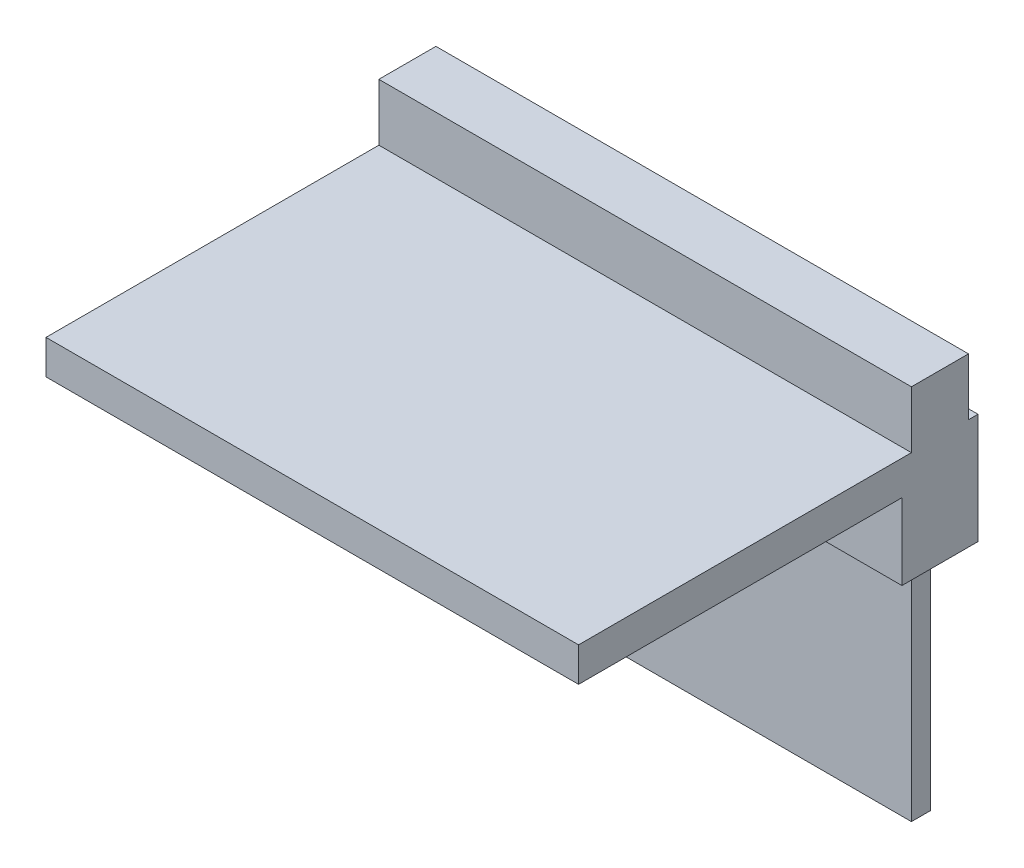
ISO-10303-21;
HEADER;
FILE_DESCRIPTION(('STEP AP214'),'2;1');
FILE_NAME('part.step','',(''),(''),'','','');
FILE_SCHEMA(('AUTOMOTIVE_DESIGN { 1 0 10303 214 1 1 1 1 }'));
ENDSEC;
DATA;
#1=APPLICATION_CONTEXT('core data for automotive mechanical design processes');
#2=APPLICATION_PROTOCOL_DEFINITION('international standard','automotive_design',2000,#1);
#3=PRODUCT_CONTEXT('',#1,'mechanical');
#4=PRODUCT('Part','Part','',(#3));
#5=PRODUCT_RELATED_PRODUCT_CATEGORY('part','',(#4));
#6=PRODUCT_DEFINITION_FORMATION('','',#4);
#7=PRODUCT_DEFINITION_CONTEXT('part definition',#1,'design');
#8=PRODUCT_DEFINITION('design','',#6,#7);
#9=PRODUCT_DEFINITION_SHAPE('','',#8);
#10=(LENGTH_UNIT() NAMED_UNIT(*) SI_UNIT(.MILLI.,.METRE.));
#11=(NAMED_UNIT(*) PLANE_ANGLE_UNIT() SI_UNIT($,.RADIAN.));
#12=(NAMED_UNIT(*) SI_UNIT($,.STERADIAN.) SOLID_ANGLE_UNIT());
#13=UNCERTAINTY_MEASURE_WITH_UNIT(LENGTH_MEASURE(1.E-05),#10,'distance_accuracy_value','');
#14=(GEOMETRIC_REPRESENTATION_CONTEXT(3) GLOBAL_UNCERTAINTY_ASSIGNED_CONTEXT((#13)) GLOBAL_UNIT_ASSIGNED_CONTEXT((#10,
#11,#12)) REPRESENTATION_CONTEXT('',''));
#15=CARTESIAN_POINT('',(0.,0.,0.));
#16=DIRECTION('',(0.,0.,1.));
#17=DIRECTION('',(1.,0.,0.));
#18=AXIS2_PLACEMENT_3D('',#15,#16,#17);
#19=CARTESIAN_POINT('',(0.,0.9,0.));
#20=DIRECTION('',(0.,-1.,0.));
#21=DIRECTION('',(0.,0.,-1.));
#22=AXIS2_PLACEMENT_3D('',#19,#20,#21);
#23=PLANE('',#22);
#24=DIRECTION('',(-1.,0.,0.));
#25=VECTOR('',#24,1.);
#26=CARTESIAN_POINT('',(7.,0.9,-5.));
#27=LINE('',#26,#25);
#28=CARTESIAN_POINT('',(7.,0.9,-5.));
#29=VERTEX_POINT('',#28);
#30=CARTESIAN_POINT('',(-7.,0.9,-5.));
#31=VERTEX_POINT('',#30);
#32=EDGE_CURVE('E153',#29,#31,#27,.T.);
#33=ORIENTED_EDGE('',*,*,#32,.F.);
#34=DIRECTION('',(0.,0.,-1.));
#35=VECTOR('',#34,1.);
#36=CARTESIAN_POINT('',(7.,0.9,5.25));
#37=LINE('',#36,#35);
#38=CARTESIAN_POINT('',(7.,0.9,-5.25));
#39=VERTEX_POINT('',#38);
#40=EDGE_CURVE('E219',#29,#39,#37,.T.);
#41=ORIENTED_EDGE('',*,*,#40,.T.);
#42=DIRECTION('',(-1.,0.,0.));
#43=VECTOR('',#42,1.);
#44=CARTESIAN_POINT('',(-7.,0.9,-5.25));
#45=LINE('',#44,#43);
#46=CARTESIAN_POINT('',(-7.,0.9,-5.25));
#47=VERTEX_POINT('',#46);
#48=EDGE_CURVE('E218',#39,#47,#45,.T.);
#49=ORIENTED_EDGE('',*,*,#48,.T.);
#50=DIRECTION('',(0.,0.,1.));
#51=VECTOR('',#50,1.);
#52=CARTESIAN_POINT('',(-7.,0.9,5.25));
#53=LINE('',#52,#51);
#54=EDGE_CURVE('E57',#47,#31,#53,.T.);
#55=ORIENTED_EDGE('',*,*,#54,.T.);
#56=EDGE_LOOP('',(#33,#41,#49,#55));
#57=FACE_BOUND('',#56,.T.);
#58=ADVANCED_FACE('F34',(#57),#23,.F.);
#59=DIRECTION('',(1.,0.,0.));
#60=VECTOR('',#59,1.);
#61=CARTESIAN_POINT('',(7.,0.9,-3.5));
#62=LINE('',#61,#60);
#63=CARTESIAN_POINT('',(-7.,0.9,-3.5));
#64=VERTEX_POINT('',#63);
#65=CARTESIAN_POINT('',(7.,0.9,-3.5));
#66=VERTEX_POINT('',#65);
#67=EDGE_CURVE('E49',#64,#66,#62,.T.);
#68=ORIENTED_EDGE('',*,*,#67,.F.);
#69=CARTESIAN_POINT('',(-7.,0.9,5.25));
#70=VERTEX_POINT('',#69);
#71=EDGE_CURVE('E157',#64,#70,#53,.T.);
#72=ORIENTED_EDGE('',*,*,#71,.T.);
#73=DIRECTION('',(1.,0.,0.));
#74=VECTOR('',#73,1.);
#75=CARTESIAN_POINT('',(-7.,0.9,5.25));
#76=LINE('',#75,#74);
#77=CARTESIAN_POINT('',(7.,0.9,5.25));
#78=VERTEX_POINT('',#77);
#79=EDGE_CURVE('E222',#70,#78,#76,.T.);
#80=ORIENTED_EDGE('',*,*,#79,.T.);
#81=EDGE_CURVE('E216',#78,#66,#37,.T.);
#82=ORIENTED_EDGE('',*,*,#81,.T.);
#83=EDGE_LOOP('',(#68,#72,#80,#82));
#84=FACE_BOUND('',#83,.T.);
#85=ADVANCED_FACE('F261',(#84),#23,.F.);
#86=CARTESIAN_POINT('',(0.,-2.,0.));
#87=DIRECTION('',(0.,1.,0.));
#88=DIRECTION('',(0.,0.,1.));
#89=AXIS2_PLACEMENT_3D('',#86,#87,#88);
#90=PLANE('',#89);
#91=DIRECTION('',(0.,0.,-1.));
#92=VECTOR('',#91,1.);
#93=CARTESIAN_POINT('',(-7.,-2.,-5.25));
#94=LINE('',#93,#92);
#95=CARTESIAN_POINT('',(-7.,-2.,-3.25));
#96=VERTEX_POINT('',#95);
#97=CARTESIAN_POINT('',(-7.,-2.,-5.25));
#98=VERTEX_POINT('',#97);
#99=EDGE_CURVE('E197',#96,#98,#94,.T.);
#100=ORIENTED_EDGE('',*,*,#99,.T.);
#101=DIRECTION('',(1.,0.,0.));
#102=VECTOR('',#101,1.);
#103=CARTESIAN_POINT('',(-7.,-2.,-5.25));
#104=LINE('',#103,#102);
#105=CARTESIAN_POINT('',(7.,-2.,-5.25));
#106=VERTEX_POINT('',#105);
#107=EDGE_CURVE('E200',#98,#106,#104,.T.);
#108=ORIENTED_EDGE('',*,*,#107,.T.);
#109=DIRECTION('',(0.,0.,1.));
#110=VECTOR('',#109,1.);
#111=CARTESIAN_POINT('',(7.,-2.,-5.25));
#112=LINE('',#111,#110);
#113=CARTESIAN_POINT('',(7.,-2.,-3.25));
#114=VERTEX_POINT('',#113);
#115=EDGE_CURVE('E203',#106,#114,#112,.T.);
#116=ORIENTED_EDGE('',*,*,#115,.T.);
#117=DIRECTION('',(-1.,0.,0.));
#118=VECTOR('',#117,1.);
#119=CARTESIAN_POINT('',(-7.,-2.,-3.25));
#120=LINE('',#119,#118);
#121=EDGE_CURVE('E205',#114,#96,#120,.T.);
#122=ORIENTED_EDGE('',*,*,#121,.T.);
#123=EDGE_LOOP('',(#100,#108,#116,#122));
#124=FACE_BOUND('',#123,.T.);
#125=DIRECTION('',(0.,0.,-1.));
#126=VECTOR('',#125,1.);
#127=CARTESIAN_POINT('',(-6.49999999999999,-2.,-4.5));
#128=LINE('',#127,#126);
#129=CARTESIAN_POINT('',(-6.49999999999999,-2.,-4.));
#130=VERTEX_POINT('',#129);
#131=CARTESIAN_POINT('',(-6.49999999999999,-2.,-4.5));
#132=VERTEX_POINT('',#131);
#133=EDGE_CURVE('E158',#130,#132,#128,.T.);
#134=ORIENTED_EDGE('',*,*,#133,.F.);
#135=DIRECTION('',(-1.,0.,0.));
#136=VECTOR('',#135,1.);
#137=CARTESIAN_POINT('',(6.50000000000001,-2.,-4.));
#138=LINE('',#137,#136);
#139=CARTESIAN_POINT('',(6.50000000000001,-2.,-4.));
#140=VERTEX_POINT('',#139);
#141=EDGE_CURVE('E171',#140,#130,#138,.T.);
#142=ORIENTED_EDGE('',*,*,#141,.F.);
#143=DIRECTION('',(0.,0.,1.));
#144=VECTOR('',#143,1.);
#145=CARTESIAN_POINT('',(6.50000000000001,-2.,-4.5));
#146=LINE('',#145,#144);
#147=CARTESIAN_POINT('',(6.50000000000001,-2.,-4.5));
#148=VERTEX_POINT('',#147);
#149=EDGE_CURVE('E180',#148,#140,#146,.T.);
#150=ORIENTED_EDGE('',*,*,#149,.F.);
#151=DIRECTION('',(1.,0.,0.));
#152=VECTOR('',#151,1.);
#153=CARTESIAN_POINT('',(6.50000000000001,-2.,-4.5));
#154=LINE('',#153,#152);
#155=EDGE_CURVE('E161',#132,#148,#154,.T.);
#156=ORIENTED_EDGE('',*,*,#155,.F.);
#157=EDGE_LOOP('',(#134,#142,#150,#156));
#158=FACE_BOUND('',#157,.T.);
#159=ADVANCED_FACE('F244',(#124,#158),#90,.F.);
#160=CARTESIAN_POINT('',(7.,0.9,5.25));
#161=DIRECTION('',(-1.,0.,0.));
#162=DIRECTION('',(0.,0.,1.));
#163=AXIS2_PLACEMENT_3D('',#160,#161,#162);
#164=PLANE('',#163);
#165=DIRECTION('',(0.,0.,-1.));
#166=VECTOR('',#165,1.);
#167=CARTESIAN_POINT('',(7.,0.,5.25));
#168=LINE('',#167,#166);
#169=CARTESIAN_POINT('',(7.,0.,5.25));
#170=VERTEX_POINT('',#169);
#171=CARTESIAN_POINT('',(7.,0.,-3.25));
#172=VERTEX_POINT('',#171);
#173=EDGE_CURVE('E215',#170,#172,#168,.T.);
#174=ORIENTED_EDGE('',*,*,#173,.T.);
#175=DIRECTION('',(0.,1.,0.));
#176=VECTOR('',#175,1.);
#177=CARTESIAN_POINT('',(7.,-2.,-3.25));
#178=LINE('',#177,#176);
#179=EDGE_CURVE('E212',#114,#172,#178,.T.);
#180=ORIENTED_EDGE('',*,*,#179,.F.);
#181=ORIENTED_EDGE('',*,*,#115,.F.);
#182=DIRECTION('',(0.,-1.,0.));
#183=VECTOR('',#182,1.);
#184=CARTESIAN_POINT('',(7.,0.9,-5.25));
#185=LINE('',#184,#183);
#186=EDGE_CURVE('E11',#39,#106,#185,.T.);
#187=ORIENTED_EDGE('',*,*,#186,.F.);
#188=ORIENTED_EDGE('',*,*,#40,.F.);
#189=DIRECTION('',(0.,-1.,0.));
#190=VECTOR('',#189,1.);
#191=CARTESIAN_POINT('',(7.,2.4,-5.));
#192=LINE('',#191,#190);
#193=CARTESIAN_POINT('',(7.,2.4,-5.));
#194=VERTEX_POINT('',#193);
#195=EDGE_CURVE('E163',#194,#29,#192,.T.);
#196=ORIENTED_EDGE('',*,*,#195,.F.);
#197=DIRECTION('',(0.,0.,-1.));
#198=VECTOR('',#197,1.);
#199=CARTESIAN_POINT('',(7.,2.4,-3.5));
#200=LINE('',#199,#198);
#201=CARTESIAN_POINT('',(7.,2.4,-3.5));
#202=VERTEX_POINT('',#201);
#203=EDGE_CURVE('E143',#202,#194,#200,.T.);
#204=ORIENTED_EDGE('',*,*,#203,.F.);
#205=DIRECTION('',(0.,-1.,0.));
#206=VECTOR('',#205,1.);
#207=CARTESIAN_POINT('',(7.,2.4,-3.5));
#208=LINE('',#207,#206);
#209=EDGE_CURVE('E140',#202,#66,#208,.T.);
#210=ORIENTED_EDGE('',*,*,#209,.T.);
#211=ORIENTED_EDGE('',*,*,#81,.F.);
#212=DIRECTION('',(0.,-1.,0.));
#213=VECTOR('',#212,1.);
#214=CARTESIAN_POINT('',(7.,0.9,5.25));
#215=LINE('',#214,#213);
#216=EDGE_CURVE('E224',#78,#170,#215,.T.);
#217=ORIENTED_EDGE('',*,*,#216,.T.);
#218=EDGE_LOOP('',(#174,#180,#181,#187,#188,#196,#204,#210,#211,#217));
#219=FACE_BOUND('',#218,.T.);
#220=ADVANCED_FACE('F36',(#219),#164,.F.);
#221=CARTESIAN_POINT('',(-7.,0.9,-5.25));
#222=DIRECTION('',(0.,0.,1.));
#223=DIRECTION('',(1.,0.,0.));
#224=AXIS2_PLACEMENT_3D('',#221,#222,#223);
#225=PLANE('',#224);
#226=ORIENTED_EDGE('',*,*,#186,.T.);
#227=ORIENTED_EDGE('',*,*,#107,.F.);
#228=DIRECTION('',(0.,-1.,0.));
#229=VECTOR('',#228,1.);
#230=CARTESIAN_POINT('',(-7.,0.9,-5.25));
#231=LINE('',#230,#229);
#232=EDGE_CURVE('E42',#47,#98,#231,.T.);
#233=ORIENTED_EDGE('',*,*,#232,.F.);
#234=ORIENTED_EDGE('',*,*,#48,.F.);
#235=EDGE_LOOP('',(#226,#227,#233,#234));
#236=FACE_BOUND('',#235,.T.);
#237=ADVANCED_FACE('F240',(#236),#225,.F.);
#238=CARTESIAN_POINT('',(-7.,0.9,5.25));
#239=DIRECTION('',(1.,0.,0.));
#240=DIRECTION('',(0.,0.,-1.));
#241=AXIS2_PLACEMENT_3D('',#238,#239,#240);
#242=PLANE('',#241);
#243=ORIENTED_EDGE('',*,*,#232,.T.);
#244=ORIENTED_EDGE('',*,*,#99,.F.);
#245=DIRECTION('',(0.,1.,0.));
#246=VECTOR('',#245,1.);
#247=CARTESIAN_POINT('',(-7.,-2.,-3.25));
#248=LINE('',#247,#246);
#249=CARTESIAN_POINT('',(-7.,0.,-3.25));
#250=VERTEX_POINT('',#249);
#251=EDGE_CURVE('E207',#96,#250,#248,.T.);
#252=ORIENTED_EDGE('',*,*,#251,.T.);
#253=DIRECTION('',(0.,0.,1.));
#254=VECTOR('',#253,1.);
#255=CARTESIAN_POINT('',(-7.,0.,5.25));
#256=LINE('',#255,#254);
#257=CARTESIAN_POINT('',(-7.,0.,5.25));
#258=VERTEX_POINT('',#257);
#259=EDGE_CURVE('E227',#250,#258,#256,.T.);
#260=ORIENTED_EDGE('',*,*,#259,.T.);
#261=DIRECTION('',(0.,-1.,0.));
#262=VECTOR('',#261,1.);
#263=CARTESIAN_POINT('',(-7.,0.9,5.25));
#264=LINE('',#263,#262);
#265=EDGE_CURVE('E233',#70,#258,#264,.T.);
#266=ORIENTED_EDGE('',*,*,#265,.F.);
#267=ORIENTED_EDGE('',*,*,#71,.F.);
#268=DIRECTION('',(0.,-1.,0.));
#269=VECTOR('',#268,1.);
#270=CARTESIAN_POINT('',(-7.,2.4,-3.5));
#271=LINE('',#270,#269);
#272=CARTESIAN_POINT('',(-7.,2.4,-3.5));
#273=VERTEX_POINT('',#272);
#274=EDGE_CURVE('E138',#273,#64,#271,.T.);
#275=ORIENTED_EDGE('',*,*,#274,.F.);
#276=DIRECTION('',(0.,0.,1.));
#277=VECTOR('',#276,1.);
#278=CARTESIAN_POINT('',(-7.,2.4,-3.5));
#279=LINE('',#278,#277);
#280=CARTESIAN_POINT('',(-7.,2.4,-5.));
#281=VERTEX_POINT('',#280);
#282=EDGE_CURVE('E144',#281,#273,#279,.T.);
#283=ORIENTED_EDGE('',*,*,#282,.F.);
#284=DIRECTION('',(0.,-1.,0.));
#285=VECTOR('',#284,1.);
#286=CARTESIAN_POINT('',(-7.,2.4,-5.));
#287=LINE('',#286,#285);
#288=EDGE_CURVE('E267',#281,#31,#287,.T.);
#289=ORIENTED_EDGE('',*,*,#288,.T.);
#290=ORIENTED_EDGE('',*,*,#54,.F.);
#291=EDGE_LOOP('',(#243,#244,#252,#260,#266,#267,#275,#283,#289,#290));
#292=FACE_BOUND('',#291,.T.);
#293=ADVANCED_FACE('F155',(#292),#242,.F.);
#294=CARTESIAN_POINT('',(-7.,0.9,5.25));
#295=DIRECTION('',(0.,0.,-1.));
#296=DIRECTION('',(-1.,0.,0.));
#297=AXIS2_PLACEMENT_3D('',#294,#295,#296);
#298=PLANE('',#297);
#299=DIRECTION('',(1.,0.,0.));
#300=VECTOR('',#299,1.);
#301=CARTESIAN_POINT('',(-7.,0.,5.25));
#302=LINE('',#301,#300);
#303=EDGE_CURVE('E229',#258,#170,#302,.T.);
#304=ORIENTED_EDGE('',*,*,#303,.T.);
#305=ORIENTED_EDGE('',*,*,#216,.F.);
#306=ORIENTED_EDGE('',*,*,#79,.F.);
#307=ORIENTED_EDGE('',*,*,#265,.T.);
#308=EDGE_LOOP('',(#304,#305,#306,#307));
#309=FACE_BOUND('',#308,.T.);
#310=ADVANCED_FACE('F255',(#309),#298,.F.);
#311=CARTESIAN_POINT('',(0.,0.,0.));
#312=DIRECTION('',(0.,-1.,0.));
#313=DIRECTION('',(0.,0.,-1.));
#314=AXIS2_PLACEMENT_3D('',#311,#312,#313);
#315=PLANE('',#314);
#316=DIRECTION('',(-1.,0.,0.));
#317=VECTOR('',#316,1.);
#318=CARTESIAN_POINT('',(-7.,0.,-3.25));
#319=LINE('',#318,#317);
#320=EDGE_CURVE('E196',#172,#250,#319,.T.);
#321=ORIENTED_EDGE('',*,*,#320,.F.);
#322=ORIENTED_EDGE('',*,*,#173,.F.);
#323=ORIENTED_EDGE('',*,*,#303,.F.);
#324=ORIENTED_EDGE('',*,*,#259,.F.);
#325=EDGE_LOOP('',(#321,#322,#323,#324));
#326=FACE_BOUND('',#325,.T.);
#327=ADVANCED_FACE('F258',(#326),#315,.T.);
#328=CARTESIAN_POINT('',(-7.,-2.,-3.25));
#329=DIRECTION('',(0.,0.,-1.));
#330=DIRECTION('',(-1.,0.,0.));
#331=AXIS2_PLACEMENT_3D('',#328,#329,#330);
#332=PLANE('',#331);
#333=ORIENTED_EDGE('',*,*,#320,.T.);
#334=ORIENTED_EDGE('',*,*,#251,.F.);
#335=ORIENTED_EDGE('',*,*,#121,.F.);
#336=ORIENTED_EDGE('',*,*,#179,.T.);
#337=EDGE_LOOP('',(#333,#334,#335,#336));
#338=FACE_BOUND('',#337,.T.);
#339=ADVANCED_FACE('F250',(#338),#332,.F.);
#340=CARTESIAN_POINT('',(-6.49999999999999,-8.,-4.5));
#341=DIRECTION('',(1.,0.,0.));
#342=DIRECTION('',(0.,0.,-1.));
#343=AXIS2_PLACEMENT_3D('',#340,#341,#342);
#344=PLANE('',#343);
#345=ORIENTED_EDGE('',*,*,#133,.T.);
#346=DIRECTION('',(0.,1.,0.));
#347=VECTOR('',#346,1.);
#348=CARTESIAN_POINT('',(-6.49999999999999,-8.,-4.5));
#349=LINE('',#348,#347);
#350=CARTESIAN_POINT('',(-6.49999999999999,-8.,-4.5));
#351=VERTEX_POINT('',#350);
#352=EDGE_CURVE('E193',#351,#132,#349,.T.);
#353=ORIENTED_EDGE('',*,*,#352,.F.);
#354=DIRECTION('',(0.,0.,-1.));
#355=VECTOR('',#354,1.);
#356=CARTESIAN_POINT('',(-6.49999999999999,-8.,-4.5));
#357=LINE('',#356,#355);
#358=CARTESIAN_POINT('',(-6.49999999999999,-8.,-4.));
#359=VERTEX_POINT('',#358);
#360=EDGE_CURVE('E167',#359,#351,#357,.T.);
#361=ORIENTED_EDGE('',*,*,#360,.F.);
#362=DIRECTION('',(0.,1.,0.));
#363=VECTOR('',#362,1.);
#364=CARTESIAN_POINT('',(-6.49999999999999,-8.,-4.));
#365=LINE('',#364,#363);
#366=EDGE_CURVE('E176',#359,#130,#365,.T.);
#367=ORIENTED_EDGE('',*,*,#366,.T.);
#368=EDGE_LOOP('',(#345,#353,#361,#367));
#369=FACE_BOUND('',#368,.T.);
#370=ADVANCED_FACE('F296',(#369),#344,.F.);
#371=CARTESIAN_POINT('',(6.50000000000001,-8.,-4.5));
#372=DIRECTION('',(0.,0.,1.));
#373=DIRECTION('',(1.,0.,0.));
#374=AXIS2_PLACEMENT_3D('',#371,#372,#373);
#375=PLANE('',#374);
#376=ORIENTED_EDGE('',*,*,#155,.T.);
#377=DIRECTION('',(0.,1.,0.));
#378=VECTOR('',#377,1.);
#379=CARTESIAN_POINT('',(6.50000000000001,-8.,-4.5));
#380=LINE('',#379,#378);
#381=CARTESIAN_POINT('',(6.50000000000001,-8.,-4.5));
#382=VERTEX_POINT('',#381);
#383=EDGE_CURVE('E190',#382,#148,#380,.T.);
#384=ORIENTED_EDGE('',*,*,#383,.F.);
#385=DIRECTION('',(1.,0.,0.));
#386=VECTOR('',#385,1.);
#387=CARTESIAN_POINT('',(6.50000000000001,-8.,-4.5));
#388=LINE('',#387,#386);
#389=EDGE_CURVE('E170',#351,#382,#388,.T.);
#390=ORIENTED_EDGE('',*,*,#389,.F.);
#391=ORIENTED_EDGE('',*,*,#352,.T.);
#392=EDGE_LOOP('',(#376,#384,#390,#391));
#393=FACE_BOUND('',#392,.T.);
#394=ADVANCED_FACE('F299',(#393),#375,.F.);
#395=CARTESIAN_POINT('',(6.50000000000001,-8.,-4.5));
#396=DIRECTION('',(-1.,0.,0.));
#397=DIRECTION('',(0.,0.,1.));
#398=AXIS2_PLACEMENT_3D('',#395,#396,#397);
#399=PLANE('',#398);
#400=ORIENTED_EDGE('',*,*,#149,.T.);
#401=DIRECTION('',(0.,1.,0.));
#402=VECTOR('',#401,1.);
#403=CARTESIAN_POINT('',(6.50000000000001,-8.,-4.));
#404=LINE('',#403,#402);
#405=CARTESIAN_POINT('',(6.50000000000001,-8.,-4.));
#406=VERTEX_POINT('',#405);
#407=EDGE_CURVE('E187',#406,#140,#404,.T.);
#408=ORIENTED_EDGE('',*,*,#407,.F.);
#409=DIRECTION('',(0.,0.,1.));
#410=VECTOR('',#409,1.);
#411=CARTESIAN_POINT('',(6.50000000000001,-8.,-4.5));
#412=LINE('',#411,#410);
#413=EDGE_CURVE('E173',#382,#406,#412,.T.);
#414=ORIENTED_EDGE('',*,*,#413,.F.);
#415=ORIENTED_EDGE('',*,*,#383,.T.);
#416=EDGE_LOOP('',(#400,#408,#414,#415));
#417=FACE_BOUND('',#416,.T.);
#418=ADVANCED_FACE('F303',(#417),#399,.F.);
#419=CARTESIAN_POINT('',(6.50000000000001,-8.,-4.));
#420=DIRECTION('',(0.,0.,-1.));
#421=DIRECTION('',(-1.,0.,0.));
#422=AXIS2_PLACEMENT_3D('',#419,#420,#421);
#423=PLANE('',#422);
#424=ORIENTED_EDGE('',*,*,#141,.T.);
#425=ORIENTED_EDGE('',*,*,#366,.F.);
#426=DIRECTION('',(-1.,0.,0.));
#427=VECTOR('',#426,1.);
#428=CARTESIAN_POINT('',(6.50000000000001,-8.,-4.));
#429=LINE('',#428,#427);
#430=EDGE_CURVE('E175',#406,#359,#429,.T.);
#431=ORIENTED_EDGE('',*,*,#430,.F.);
#432=ORIENTED_EDGE('',*,*,#407,.T.);
#433=EDGE_LOOP('',(#424,#425,#431,#432));
#434=FACE_BOUND('',#433,.T.);
#435=ADVANCED_FACE('F307',(#434),#423,.F.);
#436=CARTESIAN_POINT('',(0.,-8.,0.));
#437=DIRECTION('',(0.,-1.,0.));
#438=DIRECTION('',(0.,0.,-1.));
#439=AXIS2_PLACEMENT_3D('',#436,#437,#438);
#440=PLANE('',#439);
#441=ORIENTED_EDGE('',*,*,#360,.T.);
#442=ORIENTED_EDGE('',*,*,#389,.T.);
#443=ORIENTED_EDGE('',*,*,#413,.T.);
#444=ORIENTED_EDGE('',*,*,#430,.T.);
#445=EDGE_LOOP('',(#441,#442,#443,#444));
#446=FACE_BOUND('',#445,.T.);
#447=ADVANCED_FACE('F311',(#446),#440,.T.);
#448=CARTESIAN_POINT('',(7.,2.4,-3.5));
#449=DIRECTION('',(0.,0.,-1.));
#450=DIRECTION('',(-1.,0.,0.));
#451=AXIS2_PLACEMENT_3D('',#448,#449,#450);
#452=PLANE('',#451);
#453=ORIENTED_EDGE('',*,*,#67,.T.);
#454=ORIENTED_EDGE('',*,*,#209,.F.);
#455=DIRECTION('',(1.,0.,0.));
#456=VECTOR('',#455,1.);
#457=CARTESIAN_POINT('',(7.,2.4,-3.5));
#458=LINE('',#457,#456);
#459=EDGE_CURVE('E134',#273,#202,#458,.T.);
#460=ORIENTED_EDGE('',*,*,#459,.F.);
#461=ORIENTED_EDGE('',*,*,#274,.T.);
#462=EDGE_LOOP('',(#453,#454,#460,#461));
#463=FACE_BOUND('',#462,.T.);
#464=ADVANCED_FACE('F136',(#463),#452,.F.);
#465=CARTESIAN_POINT('',(7.,2.4,-5.));
#466=DIRECTION('',(0.,0.,1.));
#467=DIRECTION('',(1.,0.,0.));
#468=AXIS2_PLACEMENT_3D('',#465,#466,#467);
#469=PLANE('',#468);
#470=ORIENTED_EDGE('',*,*,#32,.T.);
#471=ORIENTED_EDGE('',*,*,#288,.F.);
#472=DIRECTION('',(-1.,0.,0.));
#473=VECTOR('',#472,1.);
#474=CARTESIAN_POINT('',(7.,2.4,-5.));
#475=LINE('',#474,#473);
#476=EDGE_CURVE('E149',#194,#281,#475,.T.);
#477=ORIENTED_EDGE('',*,*,#476,.F.);
#478=ORIENTED_EDGE('',*,*,#195,.T.);
#479=EDGE_LOOP('',(#470,#471,#477,#478));
#480=FACE_BOUND('',#479,.T.);
#481=ADVANCED_FACE('F271',(#480),#469,.F.);
#482=CARTESIAN_POINT('',(0.,2.4,0.));
#483=DIRECTION('',(0.,1.,0.));
#484=DIRECTION('',(0.,0.,1.));
#485=AXIS2_PLACEMENT_3D('',#482,#483,#484);
#486=PLANE('',#485);
#487=ORIENTED_EDGE('',*,*,#282,.T.);
#488=ORIENTED_EDGE('',*,*,#459,.T.);
#489=ORIENTED_EDGE('',*,*,#203,.T.);
#490=ORIENTED_EDGE('',*,*,#476,.T.);
#491=EDGE_LOOP('',(#487,#488,#489,#490));
#492=FACE_BOUND('',#491,.T.);
#493=ADVANCED_FACE('F147',(#492),#486,.T.);
#494=CLOSED_SHELL('',(#58,#85,#159,#220,#237,#293,#310,#327,#339,#370,#394,#418,#435,#447,#464,
#481,#493));
#495=MANIFOLD_SOLID_BREP('B2',#494);
#496=ADVANCED_BREP_SHAPE_REPRESENTATION('',(#18,#495),#14);
#497=SHAPE_DEFINITION_REPRESENTATION(#9,#496);
ENDSEC;
END-ISO-10303-21;
